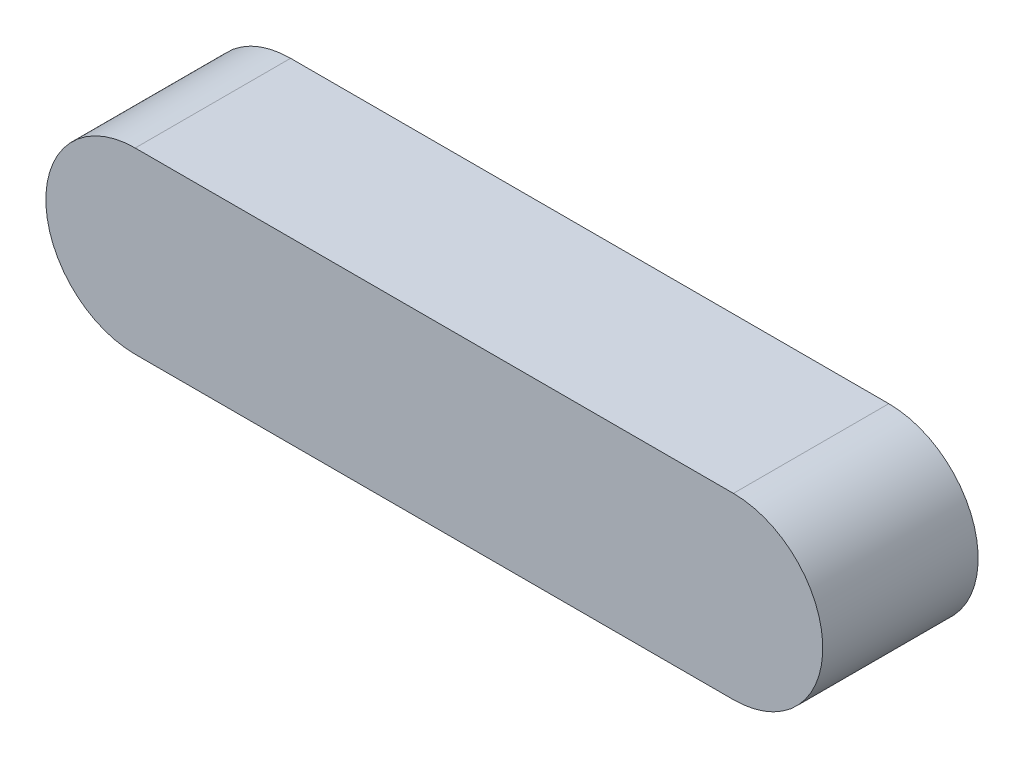
ISO-10303-21;
HEADER;
FILE_DESCRIPTION(('STEP AP214'),'2;1');
FILE_NAME('part.step','',(''),(''),'','','');
FILE_SCHEMA(('AUTOMOTIVE_DESIGN { 1 0 10303 214 1 1 1 1 }'));
ENDSEC;
DATA;
#1=APPLICATION_CONTEXT('core data for automotive mechanical design processes');
#2=APPLICATION_PROTOCOL_DEFINITION('international standard','automotive_design',2000,#1);
#3=PRODUCT_CONTEXT('',#1,'mechanical');
#4=PRODUCT('Part','Part','',(#3));
#5=PRODUCT_RELATED_PRODUCT_CATEGORY('part','',(#4));
#6=PRODUCT_DEFINITION_FORMATION('','',#4);
#7=PRODUCT_DEFINITION_CONTEXT('part definition',#1,'design');
#8=PRODUCT_DEFINITION('design','',#6,#7);
#9=PRODUCT_DEFINITION_SHAPE('','',#8);
#10=(LENGTH_UNIT() NAMED_UNIT(*) SI_UNIT(.MILLI.,.METRE.));
#11=(NAMED_UNIT(*) PLANE_ANGLE_UNIT() SI_UNIT($,.RADIAN.));
#12=(NAMED_UNIT(*) SI_UNIT($,.STERADIAN.) SOLID_ANGLE_UNIT());
#13=UNCERTAINTY_MEASURE_WITH_UNIT(LENGTH_MEASURE(1.E-05),#10,'distance_accuracy_value','');
#14=(GEOMETRIC_REPRESENTATION_CONTEXT(3) GLOBAL_UNCERTAINTY_ASSIGNED_CONTEXT((#13)) GLOBAL_UNIT_ASSIGNED_CONTEXT((#10,
#11,#12)) REPRESENTATION_CONTEXT('',''));
#15=CARTESIAN_POINT('',(0.,0.,0.));
#16=DIRECTION('',(0.,0.,1.));
#17=DIRECTION('',(1.,0.,0.));
#18=AXIS2_PLACEMENT_3D('',#15,#16,#17);
#19=CARTESIAN_POINT('',(0.,0.,20.));
#20=DIRECTION('',(0.,0.,-1.));
#21=DIRECTION('',(-1.,0.,0.));
#22=AXIS2_PLACEMENT_3D('',#19,#20,#21);
#23=CYLINDRICAL_SURFACE('',#22,11.5);
#24=CARTESIAN_POINT('',(0.,0.,0.));
#25=DIRECTION('',(0.,0.,1.));
#26=DIRECTION('',(1.,0.,0.));
#27=AXIS2_PLACEMENT_3D('',#24,#25,#26);
#28=CIRCLE('',#27,11.5);
#29=CARTESIAN_POINT('',(0.,11.5,0.));
#30=VERTEX_POINT('',#29);
#31=CARTESIAN_POINT('',(0.,-11.5,0.));
#32=VERTEX_POINT('',#31);
#33=EDGE_CURVE('E100',#30,#32,#28,.T.);
#34=ORIENTED_EDGE('',*,*,#33,.T.);
#35=DIRECTION('',(0.,0.,-1.));
#36=VECTOR('',#35,1.);
#37=CARTESIAN_POINT('',(0.,-11.5,20.));
#38=LINE('',#37,#36);
#39=CARTESIAN_POINT('',(0.,-11.5,20.));
#40=VERTEX_POINT('',#39);
#41=EDGE_CURVE('E11',#40,#32,#38,.T.);
#42=ORIENTED_EDGE('',*,*,#41,.F.);
#43=CARTESIAN_POINT('',(0.,0.,20.));
#44=DIRECTION('',(0.,0.,1.));
#45=DIRECTION('',(1.,0.,0.));
#46=AXIS2_PLACEMENT_3D('',#43,#44,#45);
#47=CIRCLE('',#46,11.5);
#48=CARTESIAN_POINT('',(0.,11.5,20.));
#49=VERTEX_POINT('',#48);
#50=EDGE_CURVE('E88',#49,#40,#47,.T.);
#51=ORIENTED_EDGE('',*,*,#50,.F.);
#52=DIRECTION('',(0.,0.,-1.));
#53=VECTOR('',#52,1.);
#54=CARTESIAN_POINT('',(0.,11.5,20.));
#55=LINE('',#54,#53);
#56=EDGE_CURVE('E96',#49,#30,#55,.T.);
#57=ORIENTED_EDGE('',*,*,#56,.T.);
#58=EDGE_LOOP('',(#34,#42,#51,#57));
#59=FACE_BOUND('',#58,.T.);
#60=ADVANCED_FACE('F37',(#59),#23,.T.);
#61=CARTESIAN_POINT('',(0.,-11.5,20.));
#62=DIRECTION('',(0.,1.,0.));
#63=DIRECTION('',(0.,0.,1.));
#64=AXIS2_PLACEMENT_3D('',#61,#62,#63);
#65=PLANE('',#64);
#66=CARTESIAN_POINT('',(38.5,-11.5,10.));
#67=DIRECTION('',(0.,-1.,0.));
#68=DIRECTION('',(0.,0.,-1.));
#69=AXIS2_PLACEMENT_3D('',#66,#67,#68);
#70=CIRCLE('',#69,3.);
#71=CARTESIAN_POINT('',(38.5,-11.5,7.));
#72=VERTEX_POINT('',#71);
#73=EDGE_CURVE('E114',#72,#72,#70,.T.);
#74=ORIENTED_EDGE('',*,*,#73,.F.);
#75=EDGE_LOOP('',(#74));
#76=FACE_BOUND('',#75,.T.);
#77=DIRECTION('',(1.,0.,0.));
#78=VECTOR('',#77,1.);
#79=CARTESIAN_POINT('',(0.,-11.5,0.));
#80=LINE('',#79,#78);
#81=CARTESIAN_POINT('',(77.,-11.5,0.));
#82=VERTEX_POINT('',#81);
#83=EDGE_CURVE('E92',#32,#82,#80,.T.);
#84=ORIENTED_EDGE('',*,*,#83,.T.);
#85=DIRECTION('',(0.,0.,-1.));
#86=VECTOR('',#85,1.);
#87=CARTESIAN_POINT('',(77.,-11.5,20.));
#88=LINE('',#87,#86);
#89=CARTESIAN_POINT('',(77.,-11.5,20.));
#90=VERTEX_POINT('',#89);
#91=EDGE_CURVE('E45',#90,#82,#88,.T.);
#92=ORIENTED_EDGE('',*,*,#91,.F.);
#93=DIRECTION('',(1.,0.,0.));
#94=VECTOR('',#93,1.);
#95=CARTESIAN_POINT('',(0.,-11.5,20.));
#96=LINE('',#95,#94);
#97=EDGE_CURVE('E83',#40,#90,#96,.T.);
#98=ORIENTED_EDGE('',*,*,#97,.F.);
#99=ORIENTED_EDGE('',*,*,#41,.T.);
#100=EDGE_LOOP('',(#84,#92,#98,#99));
#101=FACE_BOUND('',#100,.T.);
#102=ADVANCED_FACE('F91',(#76,#101),#65,.F.);
#103=CARTESIAN_POINT('',(77.,0.,20.));
#104=DIRECTION('',(0.,0.,-1.));
#105=DIRECTION('',(-1.,0.,0.));
#106=AXIS2_PLACEMENT_3D('',#103,#104,#105);
#107=CYLINDRICAL_SURFACE('',#106,11.5);
#108=CARTESIAN_POINT('',(77.,0.,0.));
#109=DIRECTION('',(0.,0.,1.));
#110=DIRECTION('',(1.,0.,0.));
#111=AXIS2_PLACEMENT_3D('',#108,#109,#110);
#112=CIRCLE('',#111,11.5);
#113=CARTESIAN_POINT('',(77.,11.5,0.));
#114=VERTEX_POINT('',#113);
#115=EDGE_CURVE('E70',#82,#114,#112,.T.);
#116=ORIENTED_EDGE('',*,*,#115,.T.);
#117=DIRECTION('',(0.,0.,-1.));
#118=VECTOR('',#117,1.);
#119=CARTESIAN_POINT('',(77.,11.5,20.));
#120=LINE('',#119,#118);
#121=CARTESIAN_POINT('',(77.,11.5,20.));
#122=VERTEX_POINT('',#121);
#123=EDGE_CURVE('E93',#122,#114,#120,.T.);
#124=ORIENTED_EDGE('',*,*,#123,.F.);
#125=CARTESIAN_POINT('',(77.,0.,20.));
#126=DIRECTION('',(0.,0.,1.));
#127=DIRECTION('',(1.,0.,0.));
#128=AXIS2_PLACEMENT_3D('',#125,#126,#127);
#129=CIRCLE('',#128,11.5);
#130=EDGE_CURVE('E86',#90,#122,#129,.T.);
#131=ORIENTED_EDGE('',*,*,#130,.F.);
#132=ORIENTED_EDGE('',*,*,#91,.T.);
#133=EDGE_LOOP('',(#116,#124,#131,#132));
#134=FACE_BOUND('',#133,.T.);
#135=ADVANCED_FACE('F94',(#134),#107,.T.);
#136=CARTESIAN_POINT('',(0.,11.5,20.));
#137=DIRECTION('',(0.,-1.,0.));
#138=DIRECTION('',(0.,0.,-1.));
#139=AXIS2_PLACEMENT_3D('',#136,#137,#138);
#140=PLANE('',#139);
#141=DIRECTION('',(-1.,0.,0.));
#142=VECTOR('',#141,1.);
#143=CARTESIAN_POINT('',(0.,11.5,0.));
#144=LINE('',#143,#142);
#145=EDGE_CURVE('E76',#114,#30,#144,.T.);
#146=ORIENTED_EDGE('',*,*,#145,.T.);
#147=ORIENTED_EDGE('',*,*,#56,.F.);
#148=DIRECTION('',(-1.,0.,0.));
#149=VECTOR('',#148,1.);
#150=CARTESIAN_POINT('',(0.,11.5,20.));
#151=LINE('',#150,#149);
#152=EDGE_CURVE('E53',#122,#49,#151,.T.);
#153=ORIENTED_EDGE('',*,*,#152,.F.);
#154=ORIENTED_EDGE('',*,*,#123,.T.);
#155=EDGE_LOOP('',(#146,#147,#153,#154));
#156=FACE_BOUND('',#155,.T.);
#157=ADVANCED_FACE('F108',(#156),#140,.F.);
#158=CARTESIAN_POINT('',(0.,0.,20.));
#159=DIRECTION('',(0.,0.,1.));
#160=DIRECTION('',(1.,0.,0.));
#161=AXIS2_PLACEMENT_3D('',#158,#159,#160);
#162=PLANE('',#161);
#163=ORIENTED_EDGE('',*,*,#50,.T.);
#164=ORIENTED_EDGE('',*,*,#97,.T.);
#165=ORIENTED_EDGE('',*,*,#130,.T.);
#166=ORIENTED_EDGE('',*,*,#152,.T.);
#167=EDGE_LOOP('',(#163,#164,#165,#166));
#168=FACE_BOUND('',#167,.T.);
#169=ADVANCED_FACE('F84',(#168),#162,.T.);
#170=CARTESIAN_POINT('',(0.,0.,0.));
#171=DIRECTION('',(0.,0.,1.));
#172=DIRECTION('',(1.,0.,0.));
#173=AXIS2_PLACEMENT_3D('',#170,#171,#172);
#174=PLANE('',#173);
#175=ORIENTED_EDGE('',*,*,#33,.F.);
#176=ORIENTED_EDGE('',*,*,#145,.F.);
#177=ORIENTED_EDGE('',*,*,#115,.F.);
#178=ORIENTED_EDGE('',*,*,#83,.F.);
#179=EDGE_LOOP('',(#175,#176,#177,#178));
#180=FACE_BOUND('',#179,.T.);
#181=ADVANCED_FACE('F111',(#180),#174,.F.);
#182=CARTESIAN_POINT('',(38.5,-6.5,10.));
#183=DIRECTION('',(0.,-1.,0.));
#184=DIRECTION('',(0.,0.,-1.));
#185=AXIS2_PLACEMENT_3D('',#182,#183,#184);
#186=CYLINDRICAL_SURFACE('',#185,3.);
#187=CARTESIAN_POINT('',(38.5,-6.5,10.));
#188=DIRECTION('',(0.,-1.,0.));
#189=DIRECTION('',(0.,0.,-1.));
#190=AXIS2_PLACEMENT_3D('',#187,#188,#189);
#191=CIRCLE('',#190,3.);
#192=CARTESIAN_POINT('',(38.5,-6.5,7.));
#193=VERTEX_POINT('',#192);
#194=EDGE_CURVE('E103',#193,#193,#191,.T.);
#195=ORIENTED_EDGE('',*,*,#194,.F.);
#196=EDGE_LOOP('',(#195));
#197=FACE_BOUND('',#196,.T.);
#198=ORIENTED_EDGE('',*,*,#73,.T.);
#199=EDGE_LOOP('',(#198));
#200=FACE_BOUND('',#199,.T.);
#201=ADVANCED_FACE('F122',(#197,#200),#186,.F.);
#202=CARTESIAN_POINT('',(38.5,-6.5,10.));
#203=DIRECTION('',(0.,-1.,0.));
#204=DIRECTION('',(0.,0.,-1.));
#205=AXIS2_PLACEMENT_3D('',#202,#203,#204);
#206=PLANE('',#205);
#207=ORIENTED_EDGE('',*,*,#194,.T.);
#208=EDGE_LOOP('',(#207));
#209=FACE_BOUND('',#208,.T.);
#210=ADVANCED_FACE('F120',(#209),#206,.T.);
#211=CLOSED_SHELL('',(#60,#102,#135,#157,#169,#181,#201,#210));
#212=MANIFOLD_SOLID_BREP('B2',#211);
#213=ADVANCED_BREP_SHAPE_REPRESENTATION('',(#18,#212),#14);
#214=SHAPE_DEFINITION_REPRESENTATION(#9,#213);
ENDSEC;
END-ISO-10303-21;
